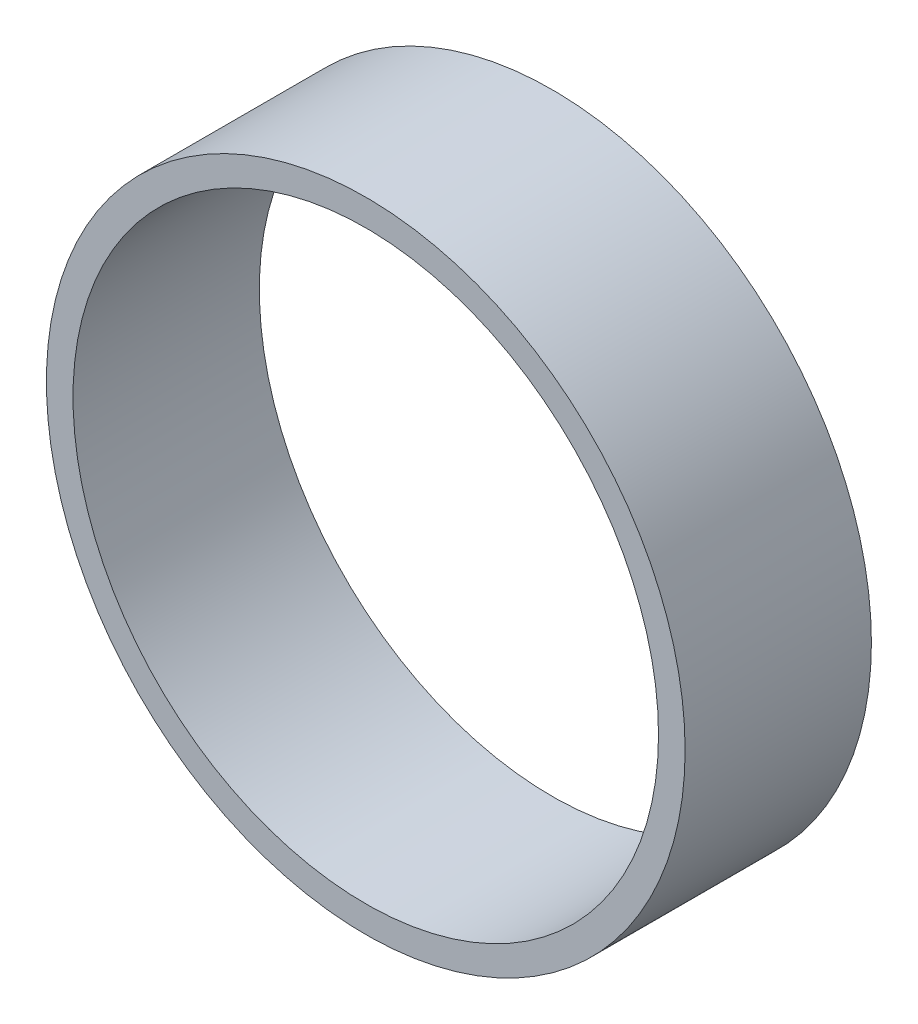
ISO-10303-21;
HEADER;
FILE_DESCRIPTION(('STEP AP214'),'2;1');
FILE_NAME('part.step','',(''),(''),'','','');
FILE_SCHEMA(('AUTOMOTIVE_DESIGN { 1 0 10303 214 1 1 1 1 }'));
ENDSEC;
DATA;
#1=APPLICATION_CONTEXT('core data for automotive mechanical design processes');
#2=APPLICATION_PROTOCOL_DEFINITION('international standard','automotive_design',2000,#1);
#3=PRODUCT_CONTEXT('',#1,'mechanical');
#4=PRODUCT('Part','Part','',(#3));
#5=PRODUCT_RELATED_PRODUCT_CATEGORY('part','',(#4));
#6=PRODUCT_DEFINITION_FORMATION('','',#4);
#7=PRODUCT_DEFINITION_CONTEXT('part definition',#1,'design');
#8=PRODUCT_DEFINITION('design','',#6,#7);
#9=PRODUCT_DEFINITION_SHAPE('','',#8);
#10=(LENGTH_UNIT() NAMED_UNIT(*) SI_UNIT(.MILLI.,.METRE.));
#11=(NAMED_UNIT(*) PLANE_ANGLE_UNIT() SI_UNIT($,.RADIAN.));
#12=(NAMED_UNIT(*) SI_UNIT($,.STERADIAN.) SOLID_ANGLE_UNIT());
#13=UNCERTAINTY_MEASURE_WITH_UNIT(LENGTH_MEASURE(1.E-05),#10,'distance_accuracy_value','');
#14=(GEOMETRIC_REPRESENTATION_CONTEXT(3) GLOBAL_UNCERTAINTY_ASSIGNED_CONTEXT((#13)) GLOBAL_UNIT_ASSIGNED_CONTEXT((#10,
#11,#12)) REPRESENTATION_CONTEXT('',''));
#15=CARTESIAN_POINT('',(0.,0.,0.));
#16=DIRECTION('',(0.,0.,1.));
#17=DIRECTION('',(1.,0.,0.));
#18=AXIS2_PLACEMENT_3D('',#15,#16,#17);
#19=CARTESIAN_POINT('',(0.,0.,328.852236800156));
#20=DIRECTION('',(0.,0.,1.));
#21=DIRECTION('',(1.,0.,0.));
#22=AXIS2_PLACEMENT_3D('',#19,#20,#21);
#23=CYLINDRICAL_SURFACE('',#22,76.2);
#24=CARTESIAN_POINT('',(0.,0.,328.852236800156));
#25=DIRECTION('',(0.,0.,1.));
#26=DIRECTION('',(1.,0.,0.));
#27=AXIS2_PLACEMENT_3D('',#24,#25,#26);
#28=CIRCLE('',#27,76.2);
#29=CARTESIAN_POINT('',(76.2,0.,328.852236800156));
#30=VERTEX_POINT('',#29);
#31=EDGE_CURVE('E10',#30,#30,#28,.T.);
#32=ORIENTED_EDGE('',*,*,#31,.T.);
#33=EDGE_LOOP('',(#32));
#34=FACE_BOUND('',#33,.T.);
#35=CARTESIAN_POINT('',(0.,0.,373.302236800156));
#36=DIRECTION('',(0.,0.,1.));
#37=DIRECTION('',(1.,0.,0.));
#38=AXIS2_PLACEMENT_3D('',#35,#36,#37);
#39=CIRCLE('',#38,76.2);
#40=CARTESIAN_POINT('',(76.2,0.,373.302236800156));
#41=VERTEX_POINT('',#40);
#42=EDGE_CURVE('E30',#41,#41,#39,.T.);
#43=ORIENTED_EDGE('',*,*,#42,.F.);
#44=EDGE_LOOP('',(#43));
#45=FACE_BOUND('',#44,.T.);
#46=ADVANCED_FACE('F24',(#34,#45),#23,.T.);
#47=CARTESIAN_POINT('',(0.,0.,328.852236800156));
#48=DIRECTION('',(0.,0.,1.));
#49=DIRECTION('',(1.,0.,0.));
#50=AXIS2_PLACEMENT_3D('',#47,#48,#49);
#51=PLANE('',#50);
#52=CARTESIAN_POINT('',(0.,0.,328.852236800156));
#53=DIRECTION('',(0.,0.,1.));
#54=DIRECTION('',(1.,0.,0.));
#55=AXIS2_PLACEMENT_3D('',#52,#53,#54);
#56=CIRCLE('',#55,69.85);
#57=CARTESIAN_POINT('',(69.85,0.,328.852236800156));
#58=VERTEX_POINT('',#57);
#59=EDGE_CURVE('E34',#58,#58,#56,.T.);
#60=ORIENTED_EDGE('',*,*,#59,.T.);
#61=EDGE_LOOP('',(#60));
#62=FACE_BOUND('',#61,.T.);
#63=ORIENTED_EDGE('',*,*,#31,.F.);
#64=EDGE_LOOP('',(#63));
#65=FACE_BOUND('',#64,.T.);
#66=ADVANCED_FACE('F48',(#62,#65),#51,.F.);
#67=CARTESIAN_POINT('',(0.,0.,373.302236800156));
#68=DIRECTION('',(0.,0.,1.));
#69=DIRECTION('',(1.,0.,0.));
#70=AXIS2_PLACEMENT_3D('',#67,#68,#69);
#71=PLANE('',#70);
#72=CARTESIAN_POINT('',(0.,0.,373.302236800156));
#73=DIRECTION('',(0.,0.,1.));
#74=DIRECTION('',(1.,0.,0.));
#75=AXIS2_PLACEMENT_3D('',#72,#73,#74);
#76=CIRCLE('',#75,69.85);
#77=CARTESIAN_POINT('',(69.85,0.,373.302236800156));
#78=VERTEX_POINT('',#77);
#79=EDGE_CURVE('E38',#78,#78,#76,.T.);
#80=ORIENTED_EDGE('',*,*,#79,.F.);
#81=EDGE_LOOP('',(#80));
#82=FACE_BOUND('',#81,.T.);
#83=ORIENTED_EDGE('',*,*,#42,.T.);
#84=EDGE_LOOP('',(#83));
#85=FACE_BOUND('',#84,.T.);
#86=ADVANCED_FACE('F46',(#82,#85),#71,.T.);
#87=CARTESIAN_POINT('',(0.,0.,328.852236800156));
#88=DIRECTION('',(0.,0.,1.));
#89=DIRECTION('',(1.,0.,0.));
#90=AXIS2_PLACEMENT_3D('',#87,#88,#89);
#91=CYLINDRICAL_SURFACE('',#90,69.85);
#92=ORIENTED_EDGE('',*,*,#59,.F.);
#93=EDGE_LOOP('',(#92));
#94=FACE_BOUND('',#93,.T.);
#95=ORIENTED_EDGE('',*,*,#79,.T.);
#96=EDGE_LOOP('',(#95));
#97=FACE_BOUND('',#96,.T.);
#98=ADVANCED_FACE('F44',(#94,#97),#91,.F.);
#99=CLOSED_SHELL('',(#46,#66,#86,#98));
#100=MANIFOLD_SOLID_BREP('B2',#99);
#101=ADVANCED_BREP_SHAPE_REPRESENTATION('',(#18,#100),#14);
#102=SHAPE_DEFINITION_REPRESENTATION(#9,#101);
ENDSEC;
END-ISO-10303-21;
